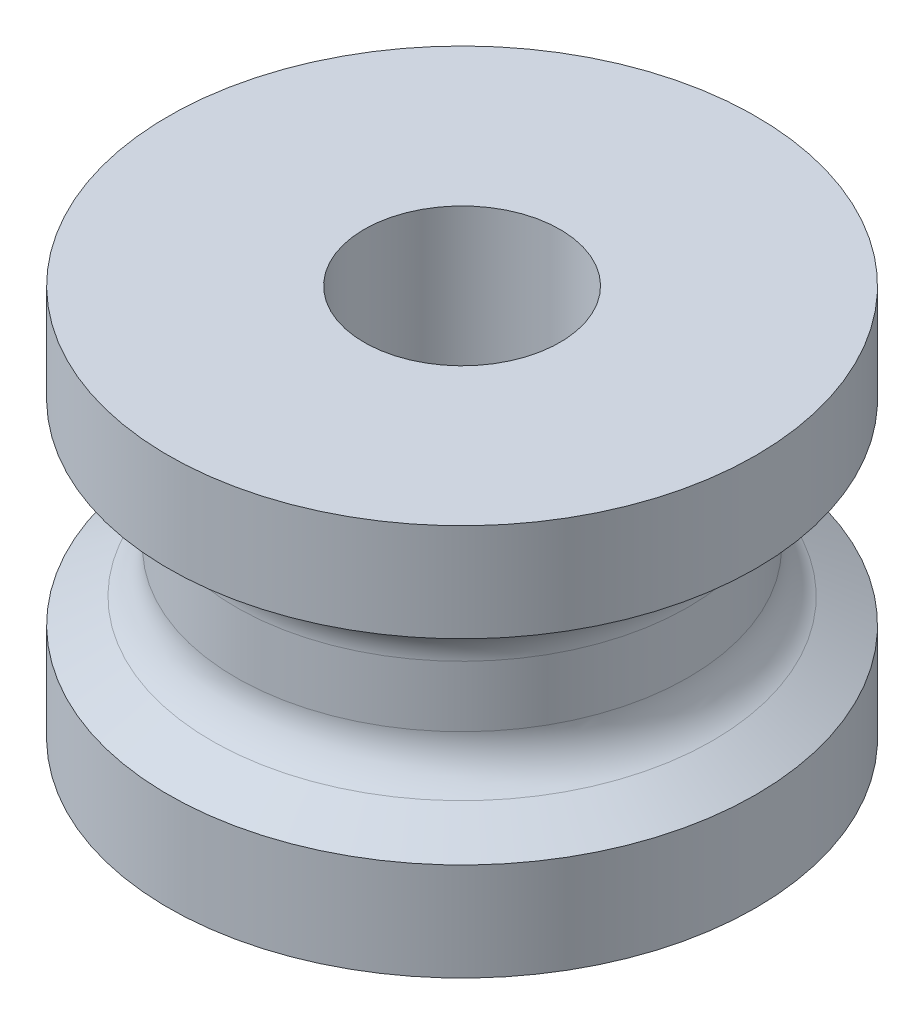
ISO-10303-21;
HEADER;
FILE_DESCRIPTION(('STEP AP214'),'2;1');
FILE_NAME('part.step','',(''),(''),'','','');
FILE_SCHEMA(('AUTOMOTIVE_DESIGN { 1 0 10303 214 1 1 1 1 }'));
ENDSEC;
DATA;
#1=APPLICATION_CONTEXT('core data for automotive mechanical design processes');
#2=APPLICATION_PROTOCOL_DEFINITION('international standard','automotive_design',2000,#1);
#3=PRODUCT_CONTEXT('',#1,'mechanical');
#4=PRODUCT('Part','Part','',(#3));
#5=PRODUCT_RELATED_PRODUCT_CATEGORY('part','',(#4));
#6=PRODUCT_DEFINITION_FORMATION('','',#4);
#7=PRODUCT_DEFINITION_CONTEXT('part definition',#1,'design');
#8=PRODUCT_DEFINITION('design','',#6,#7);
#9=PRODUCT_DEFINITION_SHAPE('','',#8);
#10=(LENGTH_UNIT() NAMED_UNIT(*) SI_UNIT(.MILLI.,.METRE.));
#11=(NAMED_UNIT(*) PLANE_ANGLE_UNIT() SI_UNIT($,.RADIAN.));
#12=(NAMED_UNIT(*) SI_UNIT($,.STERADIAN.) SOLID_ANGLE_UNIT());
#13=UNCERTAINTY_MEASURE_WITH_UNIT(LENGTH_MEASURE(1.E-05),#10,'distance_accuracy_value','');
#14=(GEOMETRIC_REPRESENTATION_CONTEXT(3) GLOBAL_UNCERTAINTY_ASSIGNED_CONTEXT((#13)) GLOBAL_UNIT_ASSIGNED_CONTEXT((#10,
#11,#12)) REPRESENTATION_CONTEXT('',''));
#15=CARTESIAN_POINT('',(0.,0.,0.));
#16=DIRECTION('',(0.,0.,1.));
#17=DIRECTION('',(1.,0.,0.));
#18=AXIS2_PLACEMENT_3D('',#15,#16,#17);
#19=CARTESIAN_POINT('',(0.,2.,0.));
#20=DIRECTION('',(0.,1.,0.));
#21=DIRECTION('',(-1.,0.,0.));
#22=AXIS2_PLACEMENT_3D('',#19,#20,#21);
#23=PLANE('',#22);
#24=CARTESIAN_POINT('',(0.,2.,0.));
#25=DIRECTION('',(0.,1.,0.));
#26=DIRECTION('',(-1.,0.,0.));
#27=AXIS2_PLACEMENT_3D('',#24,#25,#26);
#28=CIRCLE('',#27,1.);
#29=CARTESIAN_POINT('',(-1.,2.,0.));
#30=VERTEX_POINT('',#29);
#31=EDGE_CURVE('E63',#30,#30,#28,.T.);
#32=ORIENTED_EDGE('',*,*,#31,.F.);
#33=EDGE_LOOP('',(#32));
#34=FACE_BOUND('',#33,.T.);
#35=CARTESIAN_POINT('',(0.,2.,0.));
#36=DIRECTION('',(0.,-1.,0.));
#37=DIRECTION('',(1.,0.,0.));
#38=AXIS2_PLACEMENT_3D('',#35,#36,#37);
#39=CIRCLE('',#38,3.);
#40=CARTESIAN_POINT('',(3.,2.,0.));
#41=VERTEX_POINT('',#40);
#42=EDGE_CURVE('E10',#41,#41,#39,.T.);
#43=ORIENTED_EDGE('',*,*,#42,.F.);
#44=EDGE_LOOP('',(#43));
#45=FACE_BOUND('',#44,.T.);
#46=ADVANCED_FACE('F31',(#34,#45),#23,.T.);
#47=CARTESIAN_POINT('',(0.,-2.,0.));
#48=DIRECTION('',(0.,-1.,0.));
#49=DIRECTION('',(1.,0.,0.));
#50=AXIS2_PLACEMENT_3D('',#47,#48,#49);
#51=CYLINDRICAL_SURFACE('',#50,3.);
#52=ORIENTED_EDGE('',*,*,#42,.T.);
#53=EDGE_LOOP('',(#52));
#54=FACE_BOUND('',#53,.T.);
#55=CARTESIAN_POINT('',(0.,1.,0.));
#56=DIRECTION('',(0.,-1.,0.));
#57=DIRECTION('',(1.,0.,0.));
#58=AXIS2_PLACEMENT_3D('',#55,#56,#57);
#59=CIRCLE('',#58,3.);
#60=CARTESIAN_POINT('',(3.,1.,0.));
#61=VERTEX_POINT('',#60);
#62=EDGE_CURVE('E37',#61,#61,#59,.T.);
#63=ORIENTED_EDGE('',*,*,#62,.F.);
#64=EDGE_LOOP('',(#63));
#65=FACE_BOUND('',#64,.T.);
#66=ADVANCED_FACE('F80',(#54,#65),#51,.T.);
#67=CARTESIAN_POINT('',(0.,0.744337567297406,0.));
#68=DIRECTION('',(0.,1.,0.));
#69=DIRECTION('',(-1.,0.,0.));
#70=AXIS2_PLACEMENT_3D('',#67,#68,#69);
#71=CONICAL_SURFACE('',#70,2.55717967697245,1.0471975511966);
#72=ORIENTED_EDGE('',*,*,#62,.T.);
#73=EDGE_LOOP('',(#72));
#74=FACE_BOUND('',#73,.T.);
#75=CARTESIAN_POINT('',(0.,0.744337567297406,0.));
#76=DIRECTION('',(0.,-1.,0.));
#77=DIRECTION('',(1.,0.,0.));
#78=AXIS2_PLACEMENT_3D('',#75,#76,#77);
#79=CIRCLE('',#78,2.55717967697245);
#80=CARTESIAN_POINT('',(2.55717967697245,0.744337567297407,0.));
#81=VERTEX_POINT('',#80);
#82=EDGE_CURVE('E41',#81,#81,#79,.T.);
#83=ORIENTED_EDGE('',*,*,#82,.F.);
#84=EDGE_LOOP('',(#83));
#85=FACE_BOUND('',#84,.T.);
#86=ADVANCED_FACE('F84',(#74,#85),#71,.T.);
#87=CARTESIAN_POINT('',(0.,0.311324865405186,0.));
#88=DIRECTION('',(0.,-1.,0.));
#89=DIRECTION('',(1.,0.,0.));
#90=AXIS2_PLACEMENT_3D('',#87,#88,#89);
#91=TOROIDAL_SURFACE('',#90,2.80717967697245,0.5);
#92=ORIENTED_EDGE('',*,*,#82,.T.);
#93=EDGE_LOOP('',(#92));
#94=FACE_BOUND('',#93,.T.);
#95=CARTESIAN_POINT('',(0.,0.311324865405186,0.));
#96=DIRECTION('',(0.,-1.,0.));
#97=DIRECTION('',(1.,0.,0.));
#98=AXIS2_PLACEMENT_3D('',#95,#96,#97);
#99=CIRCLE('',#98,2.30717967697245);
#100=CARTESIAN_POINT('',(2.30717967697245,0.311324865405186,0.));
#101=VERTEX_POINT('',#100);
#102=EDGE_CURVE('E45',#101,#101,#99,.T.);
#103=ORIENTED_EDGE('',*,*,#102,.F.);
#104=EDGE_LOOP('',(#103));
#105=FACE_BOUND('',#104,.T.);
#106=ADVANCED_FACE('F88',(#94,#105),#91,.F.);
#107=CARTESIAN_POINT('',(0.,-2.,0.));
#108=DIRECTION('',(0.,-1.,0.));
#109=DIRECTION('',(1.,0.,0.));
#110=AXIS2_PLACEMENT_3D('',#107,#108,#109);
#111=CYLINDRICAL_SURFACE('',#110,2.30717967697245);
#112=ORIENTED_EDGE('',*,*,#102,.T.);
#113=EDGE_LOOP('',(#112));
#114=FACE_BOUND('',#113,.T.);
#115=CARTESIAN_POINT('',(0.,-0.311324865405186,0.));
#116=DIRECTION('',(0.,-1.,0.));
#117=DIRECTION('',(1.,0.,0.));
#118=AXIS2_PLACEMENT_3D('',#115,#116,#117);
#119=CIRCLE('',#118,2.30717967697245);
#120=CARTESIAN_POINT('',(2.30717967697245,-0.311324865405185,0.));
#121=VERTEX_POINT('',#120);
#122=EDGE_CURVE('E50',#121,#121,#119,.T.);
#123=ORIENTED_EDGE('',*,*,#122,.F.);
#124=EDGE_LOOP('',(#123));
#125=FACE_BOUND('',#124,.T.);
#126=ADVANCED_FACE('F94',(#114,#125),#111,.T.);
#127=CARTESIAN_POINT('',(0.,-0.311324865405186,0.));
#128=DIRECTION('',(0.,-1.,0.));
#129=DIRECTION('',(1.,0.,0.));
#130=AXIS2_PLACEMENT_3D('',#127,#128,#129);
#131=TOROIDAL_SURFACE('',#130,2.80717967697245,0.5);
#132=ORIENTED_EDGE('',*,*,#122,.T.);
#133=EDGE_LOOP('',(#132));
#134=FACE_BOUND('',#133,.T.);
#135=CARTESIAN_POINT('',(0.,-0.744337567297406,0.));
#136=DIRECTION('',(0.,-1.,0.));
#137=DIRECTION('',(1.,0.,0.));
#138=AXIS2_PLACEMENT_3D('',#135,#136,#137);
#139=CIRCLE('',#138,2.55717967697245);
#140=CARTESIAN_POINT('',(2.55717967697245,-0.744337567297405,0.));
#141=VERTEX_POINT('',#140);
#142=EDGE_CURVE('E53',#141,#141,#139,.T.);
#143=ORIENTED_EDGE('',*,*,#142,.F.);
#144=EDGE_LOOP('',(#143));
#145=FACE_BOUND('',#144,.T.);
#146=ADVANCED_FACE('F98',(#134,#145),#131,.F.);
#147=CARTESIAN_POINT('',(0.,-0.999999999999999,0.));
#148=DIRECTION('',(0.,-1.,0.));
#149=DIRECTION('',(1.,0.,0.));
#150=AXIS2_PLACEMENT_3D('',#147,#148,#149);
#151=CONICAL_SURFACE('',#150,3.,1.0471975511966);
#152=ORIENTED_EDGE('',*,*,#142,.T.);
#153=EDGE_LOOP('',(#152));
#154=FACE_BOUND('',#153,.T.);
#155=CARTESIAN_POINT('',(0.,-0.999999999999999,0.));
#156=DIRECTION('',(0.,-1.,0.));
#157=DIRECTION('',(1.,0.,0.));
#158=AXIS2_PLACEMENT_3D('',#155,#156,#157);
#159=CIRCLE('',#158,3.);
#160=CARTESIAN_POINT('',(3.,-0.999999999999998,0.));
#161=VERTEX_POINT('',#160);
#162=EDGE_CURVE('E56',#161,#161,#159,.T.);
#163=ORIENTED_EDGE('',*,*,#162,.F.);
#164=EDGE_LOOP('',(#163));
#165=FACE_BOUND('',#164,.T.);
#166=ADVANCED_FACE('F102',(#154,#165),#151,.T.);
#167=CARTESIAN_POINT('',(0.,-2.,0.));
#168=DIRECTION('',(0.,-1.,0.));
#169=DIRECTION('',(1.,0.,0.));
#170=AXIS2_PLACEMENT_3D('',#167,#168,#169);
#171=CYLINDRICAL_SURFACE('',#170,3.);
#172=ORIENTED_EDGE('',*,*,#162,.T.);
#173=EDGE_LOOP('',(#172));
#174=FACE_BOUND('',#173,.T.);
#175=CARTESIAN_POINT('',(0.,-2.,0.));
#176=DIRECTION('',(0.,-1.,0.));
#177=DIRECTION('',(1.,0.,0.));
#178=AXIS2_PLACEMENT_3D('',#175,#176,#177);
#179=CIRCLE('',#178,3.);
#180=CARTESIAN_POINT('',(3.,-2.,0.));
#181=VERTEX_POINT('',#180);
#182=EDGE_CURVE('E59',#181,#181,#179,.T.);
#183=ORIENTED_EDGE('',*,*,#182,.F.);
#184=EDGE_LOOP('',(#183));
#185=FACE_BOUND('',#184,.T.);
#186=ADVANCED_FACE('F106',(#174,#185),#171,.T.);
#187=CARTESIAN_POINT('',(0.,-2.,0.));
#188=DIRECTION('',(0.,-1.,0.));
#189=DIRECTION('',(1.,0.,0.));
#190=AXIS2_PLACEMENT_3D('',#187,#188,#189);
#191=PLANE('',#190);
#192=CARTESIAN_POINT('',(0.,-2.,0.));
#193=DIRECTION('',(0.,1.,0.));
#194=DIRECTION('',(-1.,0.,0.));
#195=AXIS2_PLACEMENT_3D('',#192,#193,#194);
#196=CIRCLE('',#195,1.);
#197=CARTESIAN_POINT('',(-1.,-2.,0.));
#198=VERTEX_POINT('',#197);
#199=EDGE_CURVE('E62',#198,#198,#196,.T.);
#200=ORIENTED_EDGE('',*,*,#199,.T.);
#201=EDGE_LOOP('',(#200));
#202=FACE_BOUND('',#201,.T.);
#203=ORIENTED_EDGE('',*,*,#182,.T.);
#204=EDGE_LOOP('',(#203));
#205=FACE_BOUND('',#204,.T.);
#206=ADVANCED_FACE('F69',(#202,#205),#191,.T.);
#207=CARTESIAN_POINT('',(0.,-2.,0.));
#208=DIRECTION('',(0.,1.,0.));
#209=DIRECTION('',(-1.,0.,0.));
#210=AXIS2_PLACEMENT_3D('',#207,#208,#209);
#211=CYLINDRICAL_SURFACE('',#210,1.);
#212=ORIENTED_EDGE('',*,*,#199,.F.);
#213=EDGE_LOOP('',(#212));
#214=FACE_BOUND('',#213,.T.);
#215=ORIENTED_EDGE('',*,*,#31,.T.);
#216=EDGE_LOOP('',(#215));
#217=FACE_BOUND('',#216,.T.);
#218=ADVANCED_FACE('F72',(#214,#217),#211,.F.);
#219=CLOSED_SHELL('',(#46,#66,#86,#106,#126,#146,#166,#186,#206,#218));
#220=MANIFOLD_SOLID_BREP('B2',#219);
#221=ADVANCED_BREP_SHAPE_REPRESENTATION('',(#18,#220),#14);
#222=SHAPE_DEFINITION_REPRESENTATION(#9,#221);
ENDSEC;
END-ISO-10303-21;
